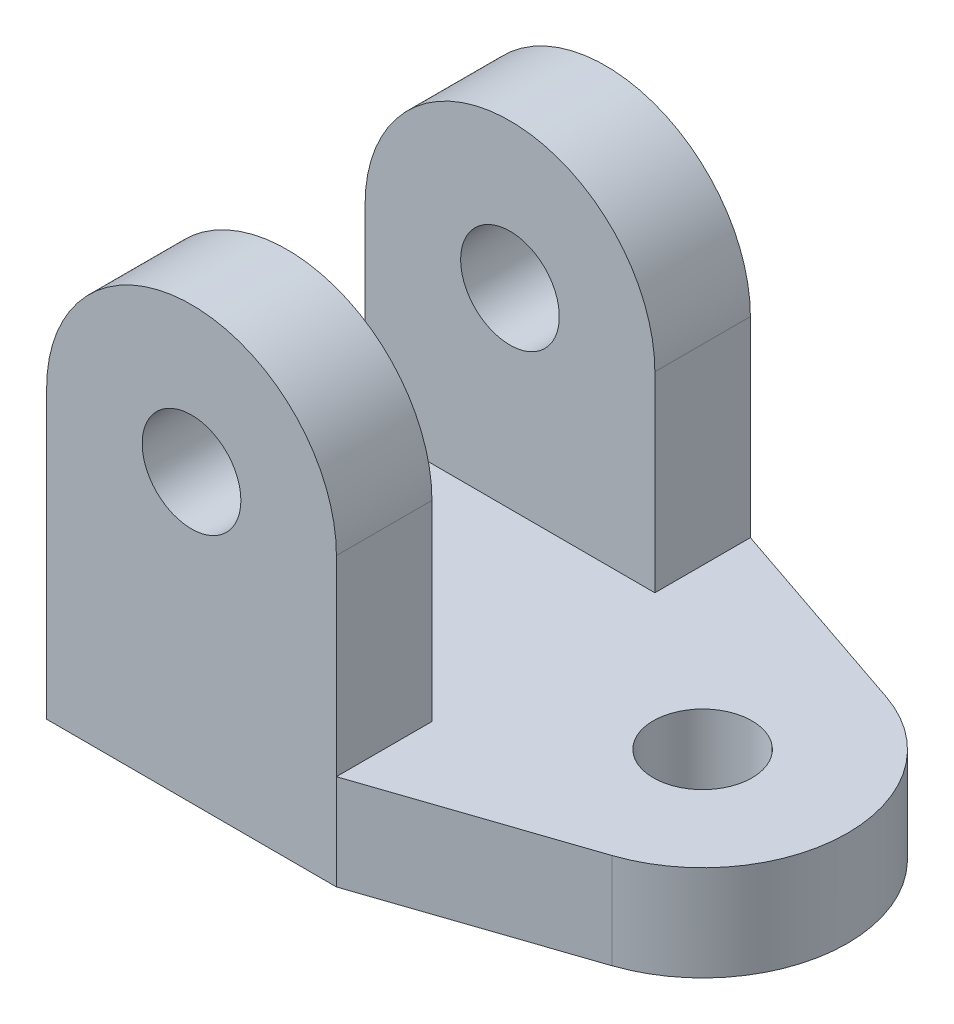
ISO-10303-21;
HEADER;
FILE_DESCRIPTION(('STEP AP214'),'2;1');
FILE_NAME('part.step','',(''),(''),'','','');
FILE_SCHEMA(('AUTOMOTIVE_DESIGN { 1 0 10303 214 1 1 1 1 }'));
ENDSEC;
DATA;
#1=APPLICATION_CONTEXT('core data for automotive mechanical design processes');
#2=APPLICATION_PROTOCOL_DEFINITION('international standard','automotive_design',2000,#1);
#3=PRODUCT_CONTEXT('',#1,'mechanical');
#4=PRODUCT('Part','Part','',(#3));
#5=PRODUCT_RELATED_PRODUCT_CATEGORY('part','',(#4));
#6=PRODUCT_DEFINITION_FORMATION('','',#4);
#7=PRODUCT_DEFINITION_CONTEXT('part definition',#1,'design');
#8=PRODUCT_DEFINITION('design','',#6,#7);
#9=PRODUCT_DEFINITION_SHAPE('','',#8);
#10=(LENGTH_UNIT() NAMED_UNIT(*) SI_UNIT(.MILLI.,.METRE.));
#11=(NAMED_UNIT(*) PLANE_ANGLE_UNIT() SI_UNIT($,.RADIAN.));
#12=(NAMED_UNIT(*) SI_UNIT($,.STERADIAN.) SOLID_ANGLE_UNIT());
#13=UNCERTAINTY_MEASURE_WITH_UNIT(LENGTH_MEASURE(1.E-05),#10,'distance_accuracy_value','');
#14=(GEOMETRIC_REPRESENTATION_CONTEXT(3) GLOBAL_UNCERTAINTY_ASSIGNED_CONTEXT((#13)) GLOBAL_UNIT_ASSIGNED_CONTEXT((#10,
#11,#12)) REPRESENTATION_CONTEXT('',''));
#15=CARTESIAN_POINT('',(0.,0.,0.));
#16=DIRECTION('',(0.,0.,1.));
#17=DIRECTION('',(1.,0.,0.));
#18=AXIS2_PLACEMENT_3D('',#15,#16,#17);
#19=CARTESIAN_POINT('',(-0.0141145084440973,-10.8957658007297,0.));
#20=DIRECTION('',(-0.00129541115874928,-0.999999160954613,0.));
#21=DIRECTION('',(0.999999160954613,-0.00129541115874928,0.));
#22=AXIS2_PLACEMENT_3D('',#19,#20,#21);
#23=PLANE('',#22);
#24=CARTESIAN_POINT('',(94.5499958047985,-11.0182653072293,-3.5));
#25=DIRECTION('',(-0.00129541115874928,-0.999999160954613,0.));
#26=DIRECTION('',(0.999999160954613,-0.00129541115874928,0.));
#27=AXIS2_PLACEMENT_3D('',#24,#25,#26);
#28=CIRCLE('',#27,1.54999999999999);
#29=CARTESIAN_POINT('',(96.0999945042781,-11.0202731945254,-3.5));
#30=VERTEX_POINT('',#29);
#31=EDGE_CURVE('E165',#30,#30,#28,.T.);
#32=ORIENTED_EDGE('',*,*,#31,.T.);
#33=EDGE_LOOP('',(#32));
#34=FACE_BOUND('',#33,.T.);
#35=DIRECTION('',(-0.999999160954613,0.00129541115874926,0.));
#36=VECTOR('',#35,1.);
#37=CARTESIAN_POINT('',(89.5500000000254,-11.0117882514356,-7.));
#38=LINE('',#37,#36);
#39=CARTESIAN_POINT('',(89.5500000000254,-11.0117882514356,-7.));
#40=VERTEX_POINT('',#39);
#41=CARTESIAN_POINT('',(80.4499999999746,-11.,-7.));
#42=VERTEX_POINT('',#41);
#43=EDGE_CURVE('E58',#40,#42,#38,.T.);
#44=ORIENTED_EDGE('',*,*,#43,.T.);
#45=DIRECTION('',(0.,0.,-1.));
#46=VECTOR('',#45,1.);
#47=CARTESIAN_POINT('',(80.4499999999746,-11.,0.));
#48=LINE('',#47,#46);
#49=CARTESIAN_POINT('',(80.4499999999746,-11.,0.));
#50=VERTEX_POINT('',#49);
#51=EDGE_CURVE('E184',#50,#42,#48,.T.);
#52=ORIENTED_EDGE('',*,*,#51,.F.);
#53=DIRECTION('',(-0.999999160954613,0.00129541115874926,0.));
#54=VECTOR('',#53,1.);
#55=CARTESIAN_POINT('',(-0.014114508444097,-10.8957658007297,0.));
#56=LINE('',#55,#54);
#57=CARTESIAN_POINT('',(89.5500000000254,-11.0117882514356,0.));
#58=VERTEX_POINT('',#57);
#59=EDGE_CURVE('E39',#58,#50,#56,.T.);
#60=ORIENTED_EDGE('',*,*,#59,.F.);
#61=DIRECTION('',(0.,0.,-1.));
#62=VECTOR('',#61,1.);
#63=CARTESIAN_POINT('',(89.5500000000254,-11.0117882514356,3.));
#64=LINE('',#63,#62);
#65=CARTESIAN_POINT('',(89.5500000000254,-11.0117882514356,3.));
#66=VERTEX_POINT('',#65);
#67=EDGE_CURVE('E11',#66,#58,#64,.T.);
#68=ORIENTED_EDGE('',*,*,#67,.F.);
#69=DIRECTION('',(0.947030642459823,-0.00122679509125672,-0.321140868180835));
#70=VECTOR('',#69,1.);
#71=CARTESIAN_POINT('',(10.1351538632099,-10.9089132872628,29.9298072220575));
#72=LINE('',#71,#70);
#73=CARTESIAN_POINT('',(96.0111855290157,-11.0201581502913,0.808993038632917));
#74=VERTEX_POINT('',#73);
#75=EDGE_CURVE('E181',#66,#74,#72,.T.);
#76=ORIENTED_EDGE('',*,*,#75,.T.);
#77=CARTESIAN_POINT('',(94.5499958047985,-11.0182653072293,-3.5));
#78=DIRECTION('',(-0.00129541115874928,-0.999999160954613,0.));
#79=DIRECTION('',(0.999999160954613,-0.00129541115874928,0.));
#80=AXIS2_PLACEMENT_3D('',#77,#78,#79);
#81=CIRCLE('',#80,4.54999999999999);
#82=CARTESIAN_POINT('',(96.0111855290157,-11.0201581502913,-7.80899303863292));
#83=VERTEX_POINT('',#82);
#84=EDGE_CURVE('E156',#83,#74,#81,.T.);
#85=ORIENTED_EDGE('',*,*,#84,.F.);
#86=DIRECTION('',(0.947030642459822,-0.00122679509125672,0.321140868180836));
#87=VECTOR('',#86,1.);
#88=CARTESIAN_POINT('',(12.2640655622038,-10.9116711055476,-36.2078870215461));
#89=LINE('',#88,#87);
#90=CARTESIAN_POINT('',(89.5500000000254,-11.0117882514356,-10.));
#91=VERTEX_POINT('',#90);
#92=EDGE_CURVE('E154',#91,#83,#89,.T.);
#93=ORIENTED_EDGE('',*,*,#92,.F.);
#94=DIRECTION('',(0.,0.,1.));
#95=VECTOR('',#94,1.);
#96=CARTESIAN_POINT('',(89.5500000000254,-11.0117882514356,-10.));
#97=LINE('',#96,#95);
#98=EDGE_CURVE('E53',#91,#40,#97,.T.);
#99=ORIENTED_EDGE('',*,*,#98,.T.);
#100=EDGE_LOOP('',(#44,#52,#60,#68,#76,#85,#93,#99));
#101=FACE_BOUND('',#100,.T.);
#102=ADVANCED_FACE('F35',(#34,#101),#23,.F.);
#103=CARTESIAN_POINT('',(89.5500000000254,0.,3.));
#104=DIRECTION('',(1.,0.,0.));
#105=DIRECTION('',(0.,0.,-1.));
#106=AXIS2_PLACEMENT_3D('',#103,#104,#105);
#107=PLANE('',#106);
#108=DIRECTION('',(0.,-1.,0.));
#109=VECTOR('',#108,1.);
#110=CARTESIAN_POINT('',(89.5500000000254,0.,0.));
#111=LINE('',#110,#109);
#112=CARTESIAN_POINT('',(89.550000000009,-5.,0.));
#113=VERTEX_POINT('',#112);
#114=EDGE_CURVE('E207',#113,#58,#111,.T.);
#115=ORIENTED_EDGE('',*,*,#114,.F.);
#116=DIRECTION('',(0.,0.,-1.));
#117=VECTOR('',#116,1.);
#118=CARTESIAN_POINT('',(89.550000000009,-5.,3.));
#119=LINE('',#118,#117);
#120=CARTESIAN_POINT('',(89.550000000009,-5.,3.));
#121=VERTEX_POINT('',#120);
#122=EDGE_CURVE('E45',#121,#113,#119,.T.);
#123=ORIENTED_EDGE('',*,*,#122,.F.);
#124=DIRECTION('',(0.,-1.,0.));
#125=VECTOR('',#124,1.);
#126=CARTESIAN_POINT('',(89.5500000000254,0.,3.));
#127=LINE('',#126,#125);
#128=EDGE_CURVE('E193',#121,#66,#127,.T.);
#129=ORIENTED_EDGE('',*,*,#128,.T.);
#130=ORIENTED_EDGE('',*,*,#67,.T.);
#131=EDGE_LOOP('',(#115,#123,#129,#130));
#132=FACE_BOUND('',#131,.T.);
#133=ADVANCED_FACE('F37',(#132),#107,.T.);
#134=CARTESIAN_POINT('',(85.,-5.,3.));
#135=DIRECTION('',(0.,0.,-1.));
#136=DIRECTION('',(-1.,0.,0.));
#137=AXIS2_PLACEMENT_3D('',#134,#135,#136);
#138=CYLINDRICAL_SURFACE('',#137,4.5499999999926);
#139=CARTESIAN_POINT('',(85.,-5.,0.));
#140=DIRECTION('',(0.,0.,1.));
#141=DIRECTION('',(1.,0.,0.));
#142=AXIS2_PLACEMENT_3D('',#139,#140,#141);
#143=CIRCLE('',#142,4.5499999999926);
#144=CARTESIAN_POINT('',(80.449999999991,-5.00000000000001,0.));
#145=VERTEX_POINT('',#144);
#146=EDGE_CURVE('E210',#113,#145,#143,.T.);
#147=ORIENTED_EDGE('',*,*,#146,.T.);
#148=DIRECTION('',(0.,0.,-1.));
#149=VECTOR('',#148,1.);
#150=CARTESIAN_POINT('',(80.449999999991,-5.00000000000001,3.));
#151=LINE('',#150,#149);
#152=CARTESIAN_POINT('',(80.449999999991,-5.00000000000001,3.));
#153=VERTEX_POINT('',#152);
#154=EDGE_CURVE('E215',#153,#145,#151,.T.);
#155=ORIENTED_EDGE('',*,*,#154,.F.);
#156=CARTESIAN_POINT('',(85.,-5.,3.));
#157=DIRECTION('',(0.,0.,1.));
#158=DIRECTION('',(1.,0.,0.));
#159=AXIS2_PLACEMENT_3D('',#156,#157,#158);
#160=CIRCLE('',#159,4.5499999999926);
#161=EDGE_CURVE('E196',#121,#153,#160,.T.);
#162=ORIENTED_EDGE('',*,*,#161,.F.);
#163=ORIENTED_EDGE('',*,*,#122,.T.);
#164=EDGE_LOOP('',(#147,#155,#162,#163));
#165=FACE_BOUND('',#164,.T.);
#166=ADVANCED_FACE('F263',(#165),#138,.T.);
#167=CARTESIAN_POINT('',(80.4499999999746,0.,3.));
#168=DIRECTION('',(1.,0.,0.));
#169=DIRECTION('',(0.,0.,-1.));
#170=AXIS2_PLACEMENT_3D('',#167,#168,#169);
#171=PLANE('',#170);
#172=DIRECTION('',(0.,-1.,0.));
#173=VECTOR('',#172,1.);
#174=CARTESIAN_POINT('',(80.4499999999746,0.,0.));
#175=LINE('',#174,#173);
#176=EDGE_CURVE('E212',#145,#50,#175,.T.);
#177=ORIENTED_EDGE('',*,*,#176,.T.);
#178=DIRECTION('',(0.,0.,-1.));
#179=VECTOR('',#178,1.);
#180=CARTESIAN_POINT('',(80.4499999999746,-11.,3.));
#181=LINE('',#180,#179);
#182=CARTESIAN_POINT('',(80.4499999999746,-11.,3.));
#183=VERTEX_POINT('',#182);
#184=EDGE_CURVE('E204',#183,#50,#181,.T.);
#185=ORIENTED_EDGE('',*,*,#184,.F.);
#186=DIRECTION('',(0.,-1.,0.));
#187=VECTOR('',#186,1.);
#188=CARTESIAN_POINT('',(80.4499999999746,0.,3.));
#189=LINE('',#188,#187);
#190=EDGE_CURVE('E199',#153,#183,#189,.T.);
#191=ORIENTED_EDGE('',*,*,#190,.F.);
#192=ORIENTED_EDGE('',*,*,#154,.T.);
#193=EDGE_LOOP('',(#177,#185,#191,#192));
#194=FACE_BOUND('',#193,.T.);
#195=ADVANCED_FACE('F229',(#194),#171,.F.);
#196=CARTESIAN_POINT('',(85.,-5.,3.));
#197=DIRECTION('',(0.,0.,-1.));
#198=DIRECTION('',(-1.,0.,0.));
#199=AXIS2_PLACEMENT_3D('',#196,#197,#198);
#200=CYLINDRICAL_SURFACE('',#199,1.54999999999259);
#201=CARTESIAN_POINT('',(85.,-5.,3.));
#202=DIRECTION('',(0.,0.,1.));
#203=DIRECTION('',(1.,0.,0.));
#204=AXIS2_PLACEMENT_3D('',#201,#202,#203);
#205=CIRCLE('',#204,1.54999999999259);
#206=CARTESIAN_POINT('',(86.5499999999926,-5.,3.));
#207=VERTEX_POINT('',#206);
#208=EDGE_CURVE('E202',#207,#207,#205,.T.);
#209=ORIENTED_EDGE('',*,*,#208,.T.);
#210=EDGE_LOOP('',(#209));
#211=FACE_BOUND('',#210,.T.);
#212=CARTESIAN_POINT('',(85.,-5.,0.));
#213=DIRECTION('',(0.,0.,1.));
#214=DIRECTION('',(1.,0.,0.));
#215=AXIS2_PLACEMENT_3D('',#212,#213,#214);
#216=CIRCLE('',#215,1.54999999999259);
#217=CARTESIAN_POINT('',(86.5499999999926,-5.,0.));
#218=VERTEX_POINT('',#217);
#219=EDGE_CURVE('E197',#218,#218,#216,.T.);
#220=ORIENTED_EDGE('',*,*,#219,.F.);
#221=EDGE_LOOP('',(#220));
#222=FACE_BOUND('',#221,.T.);
#223=ADVANCED_FACE('F413',(#211,#222),#200,.F.);
#224=CARTESIAN_POINT('',(0.,0.,3.));
#225=DIRECTION('',(0.,0.,1.));
#226=DIRECTION('',(1.,0.,0.));
#227=AXIS2_PLACEMENT_3D('',#224,#225,#226);
#228=PLANE('',#227);
#229=ORIENTED_EDGE('',*,*,#190,.T.);
#230=DIRECTION('',(0.00129541115874926,0.999999160954613,0.));
#231=VECTOR('',#230,1.);
#232=CARTESIAN_POINT('',(80.4461137664984,-13.9999974828638,3.));
#233=LINE('',#232,#231);
#234=CARTESIAN_POINT('',(80.4461137664984,-13.9999974828638,3.));
#235=VERTEX_POINT('',#234);
#236=EDGE_CURVE('E251',#235,#183,#233,.T.);
#237=ORIENTED_EDGE('',*,*,#236,.F.);
#238=DIRECTION('',(-0.999999160954613,0.00129541115874928,0.));
#239=VECTOR('',#238,1.);
#240=CARTESIAN_POINT('',(-0.0180007419203451,-13.8957632835935,3.));
#241=LINE('',#240,#239);
#242=CARTESIAN_POINT('',(89.5461137665491,-14.0117857342994,3.));
#243=VERTEX_POINT('',#242);
#244=EDGE_CURVE('E172',#243,#235,#241,.T.);
#245=ORIENTED_EDGE('',*,*,#244,.F.);
#246=DIRECTION('',(0.00129541115874926,0.999999160954613,0.));
#247=VECTOR('',#246,1.);
#248=CARTESIAN_POINT('',(89.5461137665491,-14.0117857342994,3.));
#249=LINE('',#248,#247);
#250=EDGE_CURVE('E246',#243,#66,#249,.T.);
#251=ORIENTED_EDGE('',*,*,#250,.T.);
#252=ORIENTED_EDGE('',*,*,#128,.F.);
#253=ORIENTED_EDGE('',*,*,#161,.T.);
#254=EDGE_LOOP('',(#229,#237,#245,#251,#252,#253));
#255=FACE_BOUND('',#254,.T.);
#256=ORIENTED_EDGE('',*,*,#208,.F.);
#257=EDGE_LOOP('',(#256));
#258=FACE_BOUND('',#257,.T.);
#259=ADVANCED_FACE('F258',(#255,#258),#228,.T.);
#260=CARTESIAN_POINT('',(0.,0.,0.));
#261=DIRECTION('',(0.,0.,1.));
#262=DIRECTION('',(1.,0.,0.));
#263=AXIS2_PLACEMENT_3D('',#260,#261,#262);
#264=PLANE('',#263);
#265=ORIENTED_EDGE('',*,*,#59,.T.);
#266=ORIENTED_EDGE('',*,*,#176,.F.);
#267=ORIENTED_EDGE('',*,*,#146,.F.);
#268=ORIENTED_EDGE('',*,*,#114,.T.);
#269=EDGE_LOOP('',(#265,#266,#267,#268));
#270=FACE_BOUND('',#269,.T.);
#271=ORIENTED_EDGE('',*,*,#219,.T.);
#272=EDGE_LOOP('',(#271));
#273=FACE_BOUND('',#272,.T.);
#274=ADVANCED_FACE('F234',(#270,#273),#264,.F.);
#275=CARTESIAN_POINT('',(-0.0180007419203451,-13.8957632835935,-10.));
#276=DIRECTION('',(0.,0.,1.));
#277=DIRECTION('',(1.,0.,0.));
#278=AXIS2_PLACEMENT_3D('',#275,#276,#277);
#279=PLANE('',#278);
#280=DIRECTION('',(0.00129541115874926,0.999999160954613,0.));
#281=VECTOR('',#280,1.);
#282=CARTESIAN_POINT('',(80.4461137664984,-13.9999974828638,-10.));
#283=LINE('',#282,#281);
#284=CARTESIAN_POINT('',(80.4461137664984,-13.9999974828638,-10.));
#285=VERTEX_POINT('',#284);
#286=CARTESIAN_POINT('',(80.4499999999746,-11.,-10.));
#287=VERTEX_POINT('',#286);
#288=EDGE_CURVE('E147',#285,#287,#283,.T.);
#289=ORIENTED_EDGE('',*,*,#288,.T.);
#290=DIRECTION('',(2.73161123350481E-12,1.,0.));
#291=VECTOR('',#290,1.);
#292=CARTESIAN_POINT('',(80.4499999999746,-11.,-10.));
#293=LINE('',#292,#291);
#294=CARTESIAN_POINT('',(80.449999999991,-5.,-10.));
#295=VERTEX_POINT('',#294);
#296=EDGE_CURVE('E139',#287,#295,#293,.T.);
#297=ORIENTED_EDGE('',*,*,#296,.T.);
#298=CARTESIAN_POINT('',(85.,-5.,-10.));
#299=DIRECTION('',(0.,0.,-1.));
#300=DIRECTION('',(-1.,0.,0.));
#301=AXIS2_PLACEMENT_3D('',#298,#299,#300);
#302=CIRCLE('',#301,4.55000000000899);
#303=CARTESIAN_POINT('',(89.550000000009,-5.,-10.));
#304=VERTEX_POINT('',#303);
#305=EDGE_CURVE('E127',#295,#304,#302,.T.);
#306=ORIENTED_EDGE('',*,*,#305,.T.);
#307=DIRECTION('',(2.7262549370589E-12,-1.,0.));
#308=VECTOR('',#307,1.);
#309=CARTESIAN_POINT('',(89.550000000009,-5.,-10.));
#310=LINE('',#309,#308);
#311=EDGE_CURVE('E138',#304,#91,#310,.T.);
#312=ORIENTED_EDGE('',*,*,#311,.T.);
#313=DIRECTION('',(0.00129541115874926,0.999999160954613,0.));
#314=VECTOR('',#313,1.);
#315=CARTESIAN_POINT('',(89.5461137665491,-14.0117857342994,-10.));
#316=LINE('',#315,#314);
#317=CARTESIAN_POINT('',(89.5461137665491,-14.0117857342994,-10.));
#318=VERTEX_POINT('',#317);
#319=EDGE_CURVE('E191',#318,#91,#316,.T.);
#320=ORIENTED_EDGE('',*,*,#319,.F.);
#321=DIRECTION('',(0.999999160954613,-0.00129541115874928,0.));
#322=VECTOR('',#321,1.);
#323=CARTESIAN_POINT('',(-0.0180007419203451,-13.8957632835935,-10.));
#324=LINE('',#323,#322);
#325=EDGE_CURVE('E161',#285,#318,#324,.T.);
#326=ORIENTED_EDGE('',*,*,#325,.F.);
#327=EDGE_LOOP('',(#289,#297,#306,#312,#320,#326));
#328=FACE_BOUND('',#327,.T.);
#329=CARTESIAN_POINT('',(85.,-5.,-10.));
#330=DIRECTION('',(0.,0.,-1.));
#331=DIRECTION('',(-1.,0.,0.));
#332=AXIS2_PLACEMENT_3D('',#329,#330,#331);
#333=CIRCLE('',#332,1.55000000000001);
#334=CARTESIAN_POINT('',(83.45,-5.,-10.));
#335=VERTEX_POINT('',#334);
#336=EDGE_CURVE('E283',#335,#335,#333,.T.);
#337=ORIENTED_EDGE('',*,*,#336,.F.);
#338=EDGE_LOOP('',(#337));
#339=FACE_BOUND('',#338,.T.);
#340=ADVANCED_FACE('F143',(#328,#339),#279,.F.);
#341=CARTESIAN_POINT('',(12.2601793287276,-13.9116685884115,-36.2078870215461));
#342=DIRECTION('',(-0.321140598729072,0.000416009464171881,0.94703143706218));
#343=DIRECTION('',(0.947031519010656,0.,0.321140626517994));
#344=AXIS2_PLACEMENT_3D('',#341,#342,#343);
#345=PLANE('',#344);
#346=ORIENTED_EDGE('',*,*,#92,.T.);
#347=DIRECTION('',(0.00129541115874926,0.999999160954613,0.));
#348=VECTOR('',#347,1.);
#349=CARTESIAN_POINT('',(96.0072992955395,-14.0201556331551,-7.80899303863292));
#350=LINE('',#349,#348);
#351=CARTESIAN_POINT('',(96.0072992955395,-14.0201556331551,-7.80899303863292));
#352=VERTEX_POINT('',#351);
#353=EDGE_CURVE('E237',#352,#83,#350,.T.);
#354=ORIENTED_EDGE('',*,*,#353,.F.);
#355=DIRECTION('',(0.947030642459822,-0.00122679509125672,0.321140868180836));
#356=VECTOR('',#355,1.);
#357=CARTESIAN_POINT('',(12.2601793287276,-13.9116685884115,-36.2078870215461));
#358=LINE('',#357,#356);
#359=EDGE_CURVE('E164',#318,#352,#358,.T.);
#360=ORIENTED_EDGE('',*,*,#359,.F.);
#361=ORIENTED_EDGE('',*,*,#319,.T.);
#362=EDGE_LOOP('',(#346,#354,#360,#361));
#363=FACE_BOUND('',#362,.T.);
#364=ADVANCED_FACE('F294',(#363),#345,.F.);
#365=CARTESIAN_POINT('',(94.5461095713222,-14.0182627900932,-3.5));
#366=DIRECTION('',(0.00129541115874926,0.999999160954613,0.));
#367=DIRECTION('',(-0.999999160954613,0.00129541115874926,0.));
#368=AXIS2_PLACEMENT_3D('',#365,#366,#367);
#369=CYLINDRICAL_SURFACE('',#368,4.54999999999999);
#370=ORIENTED_EDGE('',*,*,#84,.T.);
#371=DIRECTION('',(0.00129541115874926,0.999999160954613,0.));
#372=VECTOR('',#371,1.);
#373=CARTESIAN_POINT('',(96.0072992955395,-14.0201556331551,0.808993038632917));
#374=LINE('',#373,#372);
#375=CARTESIAN_POINT('',(96.0072992955395,-14.0201556331551,0.808993038632917));
#376=VERTEX_POINT('',#375);
#377=EDGE_CURVE('E241',#376,#74,#374,.T.);
#378=ORIENTED_EDGE('',*,*,#377,.F.);
#379=CARTESIAN_POINT('',(94.5461095713222,-14.0182627900932,-3.5));
#380=DIRECTION('',(-0.00129541115874928,-0.999999160954613,0.));
#381=DIRECTION('',(0.999999160954613,-0.00129541115874928,0.));
#382=AXIS2_PLACEMENT_3D('',#379,#380,#381);
#383=CIRCLE('',#382,4.54999999999999);
#384=EDGE_CURVE('E167',#352,#376,#383,.T.);
#385=ORIENTED_EDGE('',*,*,#384,.F.);
#386=ORIENTED_EDGE('',*,*,#353,.T.);
#387=EDGE_LOOP('',(#370,#378,#385,#386));
#388=FACE_BOUND('',#387,.T.);
#389=ADVANCED_FACE('F270',(#388),#369,.T.);
#390=CARTESIAN_POINT('',(10.1312676297336,-13.9089107701267,29.9298072220575));
#391=DIRECTION('',(0.32114059872907,-0.000416009464171879,0.947031437062181));
#392=DIRECTION('',(0.947031519010657,0.,-0.321140626517992));
#393=AXIS2_PLACEMENT_3D('',#390,#391,#392);
#394=PLANE('',#393);
#395=ORIENTED_EDGE('',*,*,#75,.F.);
#396=ORIENTED_EDGE('',*,*,#250,.F.);
#397=DIRECTION('',(0.947030642459823,-0.00122679509125672,-0.321140868180835));
#398=VECTOR('',#397,1.);
#399=CARTESIAN_POINT('',(10.1312676297336,-13.9089107701267,29.9298072220575));
#400=LINE('',#399,#398);
#401=EDGE_CURVE('E169',#243,#376,#400,.T.);
#402=ORIENTED_EDGE('',*,*,#401,.T.);
#403=ORIENTED_EDGE('',*,*,#377,.T.);
#404=EDGE_LOOP('',(#395,#396,#402,#403));
#405=FACE_BOUND('',#404,.T.);
#406=ADVANCED_FACE('F268',(#405),#394,.T.);
#407=CARTESIAN_POINT('',(80.4461137664984,-13.9999974828638,0.));
#408=DIRECTION('',(0.999999160954613,-0.00129541115874926,0.));
#409=DIRECTION('',(0.00129541115874926,0.999999160954613,0.));
#410=AXIS2_PLACEMENT_3D('',#407,#408,#409);
#411=PLANE('',#410);
#412=ORIENTED_EDGE('',*,*,#184,.T.);
#413=ORIENTED_EDGE('',*,*,#51,.T.);
#414=DIRECTION('',(0.,0.,1.));
#415=VECTOR('',#414,1.);
#416=CARTESIAN_POINT('',(80.4499999999746,-11.,-10.));
#417=LINE('',#416,#415);
#418=EDGE_CURVE('E272',#287,#42,#417,.T.);
#419=ORIENTED_EDGE('',*,*,#418,.F.);
#420=ORIENTED_EDGE('',*,*,#288,.F.);
#421=DIRECTION('',(0.,0.,-1.));
#422=VECTOR('',#421,1.);
#423=CARTESIAN_POINT('',(80.4461137664984,-13.9999974828638,0.));
#424=LINE('',#423,#422);
#425=EDGE_CURVE('E174',#235,#285,#424,.T.);
#426=ORIENTED_EDGE('',*,*,#425,.F.);
#427=ORIENTED_EDGE('',*,*,#236,.T.);
#428=EDGE_LOOP('',(#412,#413,#419,#420,#426,#427));
#429=FACE_BOUND('',#428,.T.);
#430=ADVANCED_FACE('F255',(#429),#411,.F.);
#431=CARTESIAN_POINT('',(94.5461095713222,-14.0182627900932,-3.5));
#432=DIRECTION('',(0.00129541115874926,0.999999160954613,0.));
#433=DIRECTION('',(-0.999999160954613,0.00129541115874926,0.));
#434=AXIS2_PLACEMENT_3D('',#431,#432,#433);
#435=CYLINDRICAL_SURFACE('',#434,1.54999999999999);
#436=CARTESIAN_POINT('',(94.5461095713222,-14.0182627900932,-3.5));
#437=DIRECTION('',(-0.00129541115874928,-0.999999160954613,0.));
#438=DIRECTION('',(0.999999160954613,-0.00129541115874928,0.));
#439=AXIS2_PLACEMENT_3D('',#436,#437,#438);
#440=CIRCLE('',#439,1.54999999999999);
#441=CARTESIAN_POINT('',(96.0961082708018,-14.0202706773892,-3.5));
#442=VERTEX_POINT('',#441);
#443=EDGE_CURVE('E176',#442,#442,#440,.T.);
#444=ORIENTED_EDGE('',*,*,#443,.T.);
#445=EDGE_LOOP('',(#444));
#446=FACE_BOUND('',#445,.T.);
#447=ORIENTED_EDGE('',*,*,#31,.F.);
#448=EDGE_LOOP('',(#447));
#449=FACE_BOUND('',#448,.T.);
#450=ADVANCED_FACE('F314',(#446,#449),#435,.F.);
#451=CARTESIAN_POINT('',(-0.0180007419203451,-13.8957632835935,0.));
#452=DIRECTION('',(-0.00129541115874928,-0.999999160954613,0.));
#453=DIRECTION('',(0.999999160954613,-0.00129541115874928,0.));
#454=AXIS2_PLACEMENT_3D('',#451,#452,#453);
#455=PLANE('',#454);
#456=ORIENTED_EDGE('',*,*,#325,.T.);
#457=ORIENTED_EDGE('',*,*,#359,.T.);
#458=ORIENTED_EDGE('',*,*,#384,.T.);
#459=ORIENTED_EDGE('',*,*,#401,.F.);
#460=ORIENTED_EDGE('',*,*,#244,.T.);
#461=ORIENTED_EDGE('',*,*,#425,.T.);
#462=EDGE_LOOP('',(#456,#457,#458,#459,#460,#461));
#463=FACE_BOUND('',#462,.T.);
#464=ORIENTED_EDGE('',*,*,#443,.F.);
#465=EDGE_LOOP('',(#464));
#466=FACE_BOUND('',#465,.T.);
#467=ADVANCED_FACE('F312',(#463,#466),#455,.T.);
#468=CARTESIAN_POINT('',(85.,-5.,-7.));
#469=DIRECTION('',(0.,0.,-1.));
#470=DIRECTION('',(-1.,0.,0.));
#471=AXIS2_PLACEMENT_3D('',#468,#469,#470);
#472=PLANE('',#471);
#473=DIRECTION('',(2.73161123350481E-12,1.,0.));
#474=VECTOR('',#473,1.);
#475=CARTESIAN_POINT('',(80.4499999999746,-11.,-7.));
#476=LINE('',#475,#474);
#477=CARTESIAN_POINT('',(80.449999999991,-5.,-7.));
#478=VERTEX_POINT('',#477);
#479=EDGE_CURVE('E153',#42,#478,#476,.T.);
#480=ORIENTED_EDGE('',*,*,#479,.F.);
#481=ORIENTED_EDGE('',*,*,#43,.F.);
#482=DIRECTION('',(2.7262549370589E-12,-1.,0.));
#483=VECTOR('',#482,1.);
#484=CARTESIAN_POINT('',(89.550000000009,-5.,-7.));
#485=LINE('',#484,#483);
#486=CARTESIAN_POINT('',(89.550000000009,-5.,-7.));
#487=VERTEX_POINT('',#486);
#488=EDGE_CURVE('E276',#487,#40,#485,.T.);
#489=ORIENTED_EDGE('',*,*,#488,.F.);
#490=CARTESIAN_POINT('',(85.,-5.,-7.));
#491=DIRECTION('',(0.,0.,-1.));
#492=DIRECTION('',(-1.,0.,0.));
#493=AXIS2_PLACEMENT_3D('',#490,#491,#492);
#494=CIRCLE('',#493,4.55000000000899);
#495=EDGE_CURVE('E281',#478,#487,#494,.T.);
#496=ORIENTED_EDGE('',*,*,#495,.F.);
#497=EDGE_LOOP('',(#480,#481,#489,#496));
#498=FACE_BOUND('',#497,.T.);
#499=CARTESIAN_POINT('',(85.,-5.,-7.));
#500=DIRECTION('',(0.,0.,-1.));
#501=DIRECTION('',(-1.,0.,0.));
#502=AXIS2_PLACEMENT_3D('',#499,#500,#501);
#503=CIRCLE('',#502,1.55000000000001);
#504=CARTESIAN_POINT('',(83.45,-5.,-7.));
#505=VERTEX_POINT('',#504);
#506=EDGE_CURVE('E285',#505,#505,#503,.T.);
#507=ORIENTED_EDGE('',*,*,#506,.T.);
#508=EDGE_LOOP('',(#507));
#509=FACE_BOUND('',#508,.T.);
#510=ADVANCED_FACE('F345',(#498,#509),#472,.F.);
#511=CARTESIAN_POINT('',(80.4499999999746,-11.,-10.));
#512=DIRECTION('',(1.,-2.73161123350481E-12,0.));
#513=DIRECTION('',(2.73161123350481E-12,1.,0.));
#514=AXIS2_PLACEMENT_3D('',#511,#512,#513);
#515=PLANE('',#514);
#516=ORIENTED_EDGE('',*,*,#479,.T.);
#517=DIRECTION('',(0.,0.,1.));
#518=VECTOR('',#517,1.);
#519=CARTESIAN_POINT('',(80.449999999991,-5.,-10.));
#520=LINE('',#519,#518);
#521=EDGE_CURVE('E131',#295,#478,#520,.T.);
#522=ORIENTED_EDGE('',*,*,#521,.F.);
#523=ORIENTED_EDGE('',*,*,#296,.F.);
#524=ORIENTED_EDGE('',*,*,#418,.T.);
#525=EDGE_LOOP('',(#516,#522,#523,#524));
#526=FACE_BOUND('',#525,.T.);
#527=ADVANCED_FACE('F151',(#526),#515,.F.);
#528=CARTESIAN_POINT('',(85.,-5.,-10.));
#529=DIRECTION('',(0.,0.,1.));
#530=DIRECTION('',(1.,0.,0.));
#531=AXIS2_PLACEMENT_3D('',#528,#529,#530);
#532=CYLINDRICAL_SURFACE('',#531,4.55000000000899);
#533=ORIENTED_EDGE('',*,*,#495,.T.);
#534=DIRECTION('',(0.,0.,1.));
#535=VECTOR('',#534,1.);
#536=CARTESIAN_POINT('',(89.550000000009,-5.,-10.));
#537=LINE('',#536,#535);
#538=EDGE_CURVE('E134',#304,#487,#537,.T.);
#539=ORIENTED_EDGE('',*,*,#538,.F.);
#540=ORIENTED_EDGE('',*,*,#305,.F.);
#541=ORIENTED_EDGE('',*,*,#521,.T.);
#542=EDGE_LOOP('',(#533,#539,#540,#541));
#543=FACE_BOUND('',#542,.T.);
#544=ADVANCED_FACE('F129',(#543),#532,.T.);
#545=CARTESIAN_POINT('',(89.550000000009,-5.,-10.));
#546=DIRECTION('',(-1.,-2.7262549370589E-12,0.));
#547=DIRECTION('',(2.7262549370589E-12,-1.,0.));
#548=AXIS2_PLACEMENT_3D('',#545,#546,#547);
#549=PLANE('',#548);
#550=ORIENTED_EDGE('',*,*,#488,.T.);
#551=ORIENTED_EDGE('',*,*,#98,.F.);
#552=ORIENTED_EDGE('',*,*,#311,.F.);
#553=ORIENTED_EDGE('',*,*,#538,.T.);
#554=EDGE_LOOP('',(#550,#551,#552,#553));
#555=FACE_BOUND('',#554,.T.);
#556=ADVANCED_FACE('F274',(#555),#549,.F.);
#557=CARTESIAN_POINT('',(85.,-5.,-10.));
#558=DIRECTION('',(0.,0.,1.));
#559=DIRECTION('',(1.,0.,0.));
#560=AXIS2_PLACEMENT_3D('',#557,#558,#559);
#561=CYLINDRICAL_SURFACE('',#560,1.55000000000001);
#562=ORIENTED_EDGE('',*,*,#336,.T.);
#563=EDGE_LOOP('',(#562));
#564=FACE_BOUND('',#563,.T.);
#565=ORIENTED_EDGE('',*,*,#506,.F.);
#566=EDGE_LOOP('',(#565));
#567=FACE_BOUND('',#566,.T.);
#568=ADVANCED_FACE('F291',(#564,#567),#561,.F.);
#569=CLOSED_SHELL('',(#102,#133,#166,#195,#223,#259,#274,#340,#364,#389,#406,#430,#450,#467,
#510,#527,#544,#556,#568));
#570=MANIFOLD_SOLID_BREP('B2',#569);
#571=ADVANCED_BREP_SHAPE_REPRESENTATION('',(#18,#570),#14);
#572=SHAPE_DEFINITION_REPRESENTATION(#9,#571);
ENDSEC;
END-ISO-10303-21;
